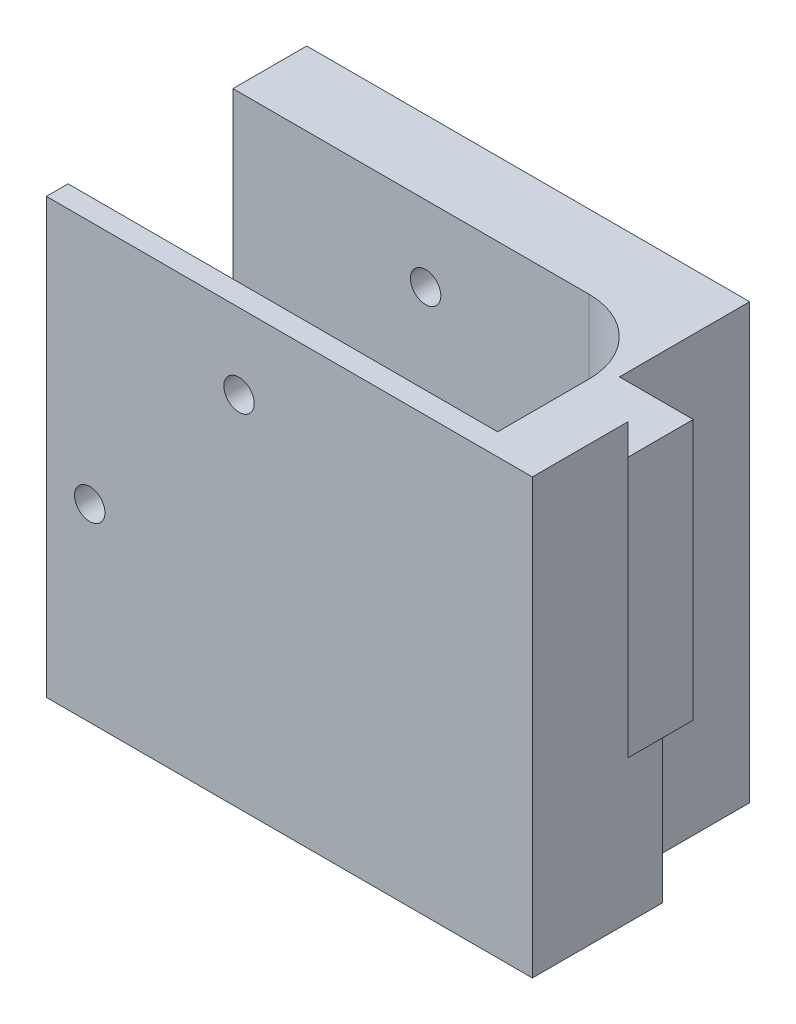
ISO-10303-21;
HEADER;
FILE_DESCRIPTION(('STEP AP214'),'2;1');
FILE_NAME('part.step','',(''),(''),'','','');
FILE_SCHEMA(('AUTOMOTIVE_DESIGN { 1 0 10303 214 1 1 1 1 }'));
ENDSEC;
DATA;
#1=APPLICATION_CONTEXT('core data for automotive mechanical design processes');
#2=APPLICATION_PROTOCOL_DEFINITION('international standard','automotive_design',2000,#1);
#3=PRODUCT_CONTEXT('',#1,'mechanical');
#4=PRODUCT('Part','Part','',(#3));
#5=PRODUCT_RELATED_PRODUCT_CATEGORY('part','',(#4));
#6=PRODUCT_DEFINITION_FORMATION('','',#4);
#7=PRODUCT_DEFINITION_CONTEXT('part definition',#1,'design');
#8=PRODUCT_DEFINITION('design','',#6,#7);
#9=PRODUCT_DEFINITION_SHAPE('','',#8);
#10=(LENGTH_UNIT() NAMED_UNIT(*) SI_UNIT(.MILLI.,.METRE.));
#11=(NAMED_UNIT(*) PLANE_ANGLE_UNIT() SI_UNIT($,.RADIAN.));
#12=(NAMED_UNIT(*) SI_UNIT($,.STERADIAN.) SOLID_ANGLE_UNIT());
#13=UNCERTAINTY_MEASURE_WITH_UNIT(LENGTH_MEASURE(1.E-05),#10,'distance_accuracy_value','');
#14=(GEOMETRIC_REPRESENTATION_CONTEXT(3) GLOBAL_UNCERTAINTY_ASSIGNED_CONTEXT((#13)) GLOBAL_UNIT_ASSIGNED_CONTEXT((#10,
#11,#12)) REPRESENTATION_CONTEXT('',''));
#15=CARTESIAN_POINT('',(0.,0.,0.));
#16=DIRECTION('',(0.,0.,1.));
#17=DIRECTION('',(1.,0.,0.));
#18=AXIS2_PLACEMENT_3D('',#15,#16,#17);
#19=CARTESIAN_POINT('',(71.0355339059328,-0.0100000000000031,15.));
#20=DIRECTION('',(0.,0.,1.));
#21=DIRECTION('',(1.,0.,0.));
#22=AXIS2_PLACEMENT_3D('',#19,#20,#21);
#23=PLANE('',#22);
#24=DIRECTION('',(0.,1.,0.));
#25=VECTOR('',#24,1.);
#26=CARTESIAN_POINT('',(51.0355339059328,-0.0100000000000031,15.));
#27=LINE('',#26,#25);
#28=CARTESIAN_POINT('',(51.0355339059328,0.,15.));
#29=VERTEX_POINT('',#28);
#30=CARTESIAN_POINT('',(51.0355339059328,50.,15.));
#31=VERTEX_POINT('',#30);
#32=EDGE_CURVE('E11',#29,#31,#27,.T.);
#33=ORIENTED_EDGE('',*,*,#32,.T.);
#34=DIRECTION('',(1.,0.,0.));
#35=VECTOR('',#34,1.);
#36=CARTESIAN_POINT('',(0.,50.,15.));
#37=LINE('',#36,#35);
#38=CARTESIAN_POINT('',(59.5355339059328,50.,15.));
#39=VERTEX_POINT('',#38);
#40=EDGE_CURVE('E308',#31,#39,#37,.T.);
#41=ORIENTED_EDGE('',*,*,#40,.T.);
#42=DIRECTION('',(0.,-1.,0.));
#43=VECTOR('',#42,1.);
#44=CARTESIAN_POINT('',(59.5355339059328,20.,15.));
#45=LINE('',#44,#43);
#46=CARTESIAN_POINT('',(59.5355339059328,20.,15.));
#47=VERTEX_POINT('',#46);
#48=EDGE_CURVE('E49',#39,#47,#45,.T.);
#49=ORIENTED_EDGE('',*,*,#48,.T.);
#50=DIRECTION('',(-1.,0.,0.));
#51=VECTOR('',#50,1.);
#52=CARTESIAN_POINT('',(0.,20.,15.));
#53=LINE('',#52,#51);
#54=CARTESIAN_POINT('',(56.,20.,15.));
#55=VERTEX_POINT('',#54);
#56=EDGE_CURVE('E64',#47,#55,#53,.T.);
#57=ORIENTED_EDGE('',*,*,#56,.T.);
#58=DIRECTION('',(0.,1.,0.));
#59=VECTOR('',#58,1.);
#60=CARTESIAN_POINT('',(56.,0.,15.));
#61=LINE('',#60,#59);
#62=CARTESIAN_POINT('',(56.,0.,15.));
#63=VERTEX_POINT('',#62);
#64=EDGE_CURVE('E152',#63,#55,#61,.T.);
#65=ORIENTED_EDGE('',*,*,#64,.F.);
#66=DIRECTION('',(1.,0.,0.));
#67=VECTOR('',#66,1.);
#68=CARTESIAN_POINT('',(0.,0.,15.));
#69=LINE('',#68,#67);
#70=EDGE_CURVE('E318',#29,#63,#69,.T.);
#71=ORIENTED_EDGE('',*,*,#70,.F.);
#72=EDGE_LOOP('',(#33,#41,#49,#57,#65,#71));
#73=FACE_BOUND('',#72,.T.);
#74=ADVANCED_FACE('F39',(#73),#23,.F.);
#75=CARTESIAN_POINT('',(51.0355339059328,-0.0100000000000031,15.));
#76=DIRECTION('',(-1.,0.,0.));
#77=DIRECTION('',(0.,0.,1.));
#78=AXIS2_PLACEMENT_3D('',#75,#76,#77);
#79=PLANE('',#78);
#80=DIRECTION('',(0.,-1.,0.));
#81=VECTOR('',#80,1.);
#82=CARTESIAN_POINT('',(51.0355339059328,0.,0.));
#83=LINE('',#82,#81);
#84=CARTESIAN_POINT('',(51.0355339059328,50.,0.));
#85=VERTEX_POINT('',#84);
#86=CARTESIAN_POINT('',(51.0355339059328,0.,0.));
#87=VERTEX_POINT('',#86);
#88=EDGE_CURVE('E155',#85,#87,#83,.T.);
#89=ORIENTED_EDGE('',*,*,#88,.F.);
#90=DIRECTION('',(0.,0.,1.));
#91=VECTOR('',#90,1.);
#92=CARTESIAN_POINT('',(51.0355339059328,50.,30.));
#93=LINE('',#92,#91);
#94=EDGE_CURVE('E311',#85,#31,#93,.T.);
#95=ORIENTED_EDGE('',*,*,#94,.T.);
#96=ORIENTED_EDGE('',*,*,#32,.F.);
#97=DIRECTION('',(0.,0.,1.));
#98=VECTOR('',#97,1.);
#99=CARTESIAN_POINT('',(51.0355339059328,0.,30.));
#100=LINE('',#99,#98);
#101=EDGE_CURVE('E43',#87,#29,#100,.T.);
#102=ORIENTED_EDGE('',*,*,#101,.F.);
#103=EDGE_LOOP('',(#89,#95,#96,#102));
#104=FACE_BOUND('',#103,.T.);
#105=ADVANCED_FACE('F41',(#104),#79,.F.);
#106=CARTESIAN_POINT('',(0.,0.,30.));
#107=DIRECTION('',(-1.,0.,0.));
#108=DIRECTION('',(0.,0.,1.));
#109=AXIS2_PLACEMENT_3D('',#106,#107,#108);
#110=PLANE('',#109);
#111=DIRECTION('',(0.,1.,0.));
#112=VECTOR('',#111,1.);
#113=CARTESIAN_POINT('',(0.,0.,27.5));
#114=LINE('',#113,#112);
#115=CARTESIAN_POINT('',(0.,0.,27.5));
#116=VERTEX_POINT('',#115);
#117=CARTESIAN_POINT('',(0.,50.,27.5));
#118=VERTEX_POINT('',#117);
#119=EDGE_CURVE('E214',#116,#118,#114,.T.);
#120=ORIENTED_EDGE('',*,*,#119,.F.);
#121=DIRECTION('',(0.,0.,-1.));
#122=VECTOR('',#121,1.);
#123=CARTESIAN_POINT('',(0.,0.,30.));
#124=LINE('',#123,#122);
#125=CARTESIAN_POINT('',(0.,0.,30.));
#126=VERTEX_POINT('',#125);
#127=EDGE_CURVE('E283',#126,#116,#124,.T.);
#128=ORIENTED_EDGE('',*,*,#127,.F.);
#129=DIRECTION('',(0.,1.,0.));
#130=VECTOR('',#129,1.);
#131=CARTESIAN_POINT('',(0.,0.,30.));
#132=LINE('',#131,#130);
#133=CARTESIAN_POINT('',(0.,50.,30.));
#134=VERTEX_POINT('',#133);
#135=EDGE_CURVE('E268',#126,#134,#132,.T.);
#136=ORIENTED_EDGE('',*,*,#135,.T.);
#137=DIRECTION('',(0.,0.,-1.));
#138=VECTOR('',#137,1.);
#139=CARTESIAN_POINT('',(0.,50.,30.));
#140=LINE('',#139,#138);
#141=EDGE_CURVE('E288',#134,#118,#140,.T.);
#142=ORIENTED_EDGE('',*,*,#141,.T.);
#143=EDGE_LOOP('',(#120,#128,#136,#142));
#144=FACE_BOUND('',#143,.T.);
#145=ADVANCED_FACE('F337',(#144),#110,.T.);
#146=CARTESIAN_POINT('',(22.2,41.3,30.));
#147=DIRECTION('',(0.,0.,-1.));
#148=DIRECTION('',(-1.,0.,0.));
#149=AXIS2_PLACEMENT_3D('',#146,#147,#148);
#150=CYLINDRICAL_SURFACE('',#149,1.75);
#151=CARTESIAN_POINT('',(22.2,41.3,27.5));
#152=DIRECTION('',(0.,0.,1.));
#153=DIRECTION('',(1.,0.,0.));
#154=AXIS2_PLACEMENT_3D('',#151,#152,#153);
#155=CIRCLE('',#154,1.75);
#156=CARTESIAN_POINT('',(23.95,41.3,27.5));
#157=VERTEX_POINT('',#156);
#158=EDGE_CURVE('E235',#157,#157,#155,.F.);
#159=ORIENTED_EDGE('',*,*,#158,.T.);
#160=EDGE_LOOP('',(#159));
#161=FACE_BOUND('',#160,.T.);
#162=CARTESIAN_POINT('',(22.2,41.3,30.));
#163=DIRECTION('',(0.,0.,-1.));
#164=DIRECTION('',(-1.,0.,0.));
#165=AXIS2_PLACEMENT_3D('',#162,#163,#164);
#166=CIRCLE('',#165,1.75);
#167=CARTESIAN_POINT('',(20.45,41.3,30.));
#168=VERTEX_POINT('',#167);
#169=EDGE_CURVE('E249',#168,#168,#166,.T.);
#170=ORIENTED_EDGE('',*,*,#169,.F.);
#171=EDGE_LOOP('',(#170));
#172=FACE_BOUND('',#171,.T.);
#173=ADVANCED_FACE('F378',(#161,#172),#150,.F.);
#174=CARTESIAN_POINT('',(5.,21.8,30.));
#175=DIRECTION('',(0.,0.,-1.));
#176=DIRECTION('',(-1.,0.,0.));
#177=AXIS2_PLACEMENT_3D('',#174,#175,#176);
#178=CYLINDRICAL_SURFACE('',#177,1.75);
#179=CARTESIAN_POINT('',(5.,21.8,27.5));
#180=DIRECTION('',(0.,0.,1.));
#181=DIRECTION('',(1.,0.,0.));
#182=AXIS2_PLACEMENT_3D('',#179,#180,#181);
#183=CIRCLE('',#182,1.75);
#184=CARTESIAN_POINT('',(6.75,21.8,27.5));
#185=VERTEX_POINT('',#184);
#186=EDGE_CURVE('E234',#185,#185,#183,.F.);
#187=ORIENTED_EDGE('',*,*,#186,.T.);
#188=EDGE_LOOP('',(#187));
#189=FACE_BOUND('',#188,.T.);
#190=CARTESIAN_POINT('',(5.,21.8,30.));
#191=DIRECTION('',(0.,0.,-1.));
#192=DIRECTION('',(-1.,0.,0.));
#193=AXIS2_PLACEMENT_3D('',#190,#191,#192);
#194=CIRCLE('',#193,1.75);
#195=CARTESIAN_POINT('',(3.25,21.8,30.));
#196=VERTEX_POINT('',#195);
#197=EDGE_CURVE('E240',#196,#196,#194,.T.);
#198=ORIENTED_EDGE('',*,*,#197,.F.);
#199=EDGE_LOOP('',(#198));
#200=FACE_BOUND('',#199,.T.);
#201=ADVANCED_FACE('F391',(#189,#200),#178,.F.);
#202=CARTESIAN_POINT('',(0.,0.,30.));
#203=DIRECTION('',(0.,1.,0.));
#204=DIRECTION('',(0.,0.,1.));
#205=AXIS2_PLACEMENT_3D('',#202,#203,#204);
#206=PLANE('',#205);
#207=DIRECTION('',(1.,0.,0.));
#208=VECTOR('',#207,1.);
#209=CARTESIAN_POINT('',(0.,0.,0.));
#210=LINE('',#209,#208);
#211=CARTESIAN_POINT('',(0.,0.,0.));
#212=VERTEX_POINT('',#211);
#213=EDGE_CURVE('E244',#212,#87,#210,.T.);
#214=ORIENTED_EDGE('',*,*,#213,.T.);
#215=ORIENTED_EDGE('',*,*,#101,.T.);
#216=ORIENTED_EDGE('',*,*,#70,.T.);
#217=DIRECTION('',(0.,0.,-1.));
#218=VECTOR('',#217,1.);
#219=CARTESIAN_POINT('',(56.,0.,30.));
#220=LINE('',#219,#218);
#221=CARTESIAN_POINT('',(56.,0.,30.));
#222=VERTEX_POINT('',#221);
#223=EDGE_CURVE('E156',#222,#63,#220,.T.);
#224=ORIENTED_EDGE('',*,*,#223,.F.);
#225=DIRECTION('',(1.,0.,0.));
#226=VECTOR('',#225,1.);
#227=CARTESIAN_POINT('',(0.,0.,30.));
#228=LINE('',#227,#226);
#229=EDGE_CURVE('E256',#126,#222,#228,.T.);
#230=ORIENTED_EDGE('',*,*,#229,.F.);
#231=ORIENTED_EDGE('',*,*,#127,.T.);
#232=DIRECTION('',(1.,0.,0.));
#233=VECTOR('',#232,1.);
#234=CARTESIAN_POINT('',(49.5,0.,27.5));
#235=LINE('',#234,#233);
#236=CARTESIAN_POINT('',(49.5,0.,27.5));
#237=VERTEX_POINT('',#236);
#238=EDGE_CURVE('E183',#116,#237,#235,.T.);
#239=ORIENTED_EDGE('',*,*,#238,.T.);
#240=DIRECTION('',(0.,0.,-1.));
#241=VECTOR('',#240,1.);
#242=CARTESIAN_POINT('',(49.5,0.,17.));
#243=LINE('',#242,#241);
#244=CARTESIAN_POINT('',(49.5,0.,17.));
#245=VERTEX_POINT('',#244);
#246=EDGE_CURVE('E187',#237,#245,#243,.T.);
#247=ORIENTED_EDGE('',*,*,#246,.T.);
#248=CARTESIAN_POINT('',(41.,0.,17.));
#249=DIRECTION('',(0.,1.,0.));
#250=DIRECTION('',(0.,0.,1.));
#251=AXIS2_PLACEMENT_3D('',#248,#249,#250);
#252=CIRCLE('',#251,8.50000000000001);
#253=CARTESIAN_POINT('',(41.,0.,8.49999999999999));
#254=VERTEX_POINT('',#253);
#255=EDGE_CURVE('E192',#245,#254,#252,.T.);
#256=ORIENTED_EDGE('',*,*,#255,.T.);
#257=DIRECTION('',(-1.,0.,0.));
#258=VECTOR('',#257,1.);
#259=CARTESIAN_POINT('',(0.,0.,8.49999999999999));
#260=LINE('',#259,#258);
#261=CARTESIAN_POINT('',(0.,0.,8.49999999999999));
#262=VERTEX_POINT('',#261);
#263=EDGE_CURVE('E196',#254,#262,#260,.T.);
#264=ORIENTED_EDGE('',*,*,#263,.T.);
#265=EDGE_CURVE('E272',#262,#212,#124,.T.);
#266=ORIENTED_EDGE('',*,*,#265,.T.);
#267=EDGE_LOOP('',(#214,#215,#216,#224,#230,#231,#239,#247,#256,#264,#266));
#268=FACE_BOUND('',#267,.T.);
#269=ADVANCED_FACE('F325',(#268),#206,.F.);
#270=CARTESIAN_POINT('',(56.,0.,30.));
#271=DIRECTION('',(-1.,0.,0.));
#272=DIRECTION('',(0.,-1.,0.));
#273=AXIS2_PLACEMENT_3D('',#270,#271,#272);
#274=PLANE('',#273);
#275=ORIENTED_EDGE('',*,*,#223,.T.);
#276=ORIENTED_EDGE('',*,*,#64,.T.);
#277=DIRECTION('',(0.,0.,1.));
#278=VECTOR('',#277,1.);
#279=CARTESIAN_POINT('',(56.,20.,30.));
#280=LINE('',#279,#278);
#281=CARTESIAN_POINT('',(56.,20.,18.9644660940673));
#282=VERTEX_POINT('',#281);
#283=EDGE_CURVE('E144',#55,#282,#280,.T.);
#284=ORIENTED_EDGE('',*,*,#283,.T.);
#285=DIRECTION('',(0.,1.,0.));
#286=VECTOR('',#285,1.);
#287=CARTESIAN_POINT('',(56.,20.,18.9644660940673));
#288=LINE('',#287,#286);
#289=CARTESIAN_POINT('',(56.,50.,18.9644660940673));
#290=VERTEX_POINT('',#289);
#291=EDGE_CURVE('E149',#282,#290,#288,.T.);
#292=ORIENTED_EDGE('',*,*,#291,.T.);
#293=DIRECTION('',(0.,0.,-1.));
#294=VECTOR('',#293,1.);
#295=CARTESIAN_POINT('',(56.,50.,30.));
#296=LINE('',#295,#294);
#297=CARTESIAN_POINT('',(56.,50.,30.));
#298=VERTEX_POINT('',#297);
#299=EDGE_CURVE('E292',#298,#290,#296,.T.);
#300=ORIENTED_EDGE('',*,*,#299,.F.);
#301=DIRECTION('',(0.,1.,0.));
#302=VECTOR('',#301,1.);
#303=CARTESIAN_POINT('',(56.,0.,30.));
#304=LINE('',#303,#302);
#305=EDGE_CURVE('E260',#222,#298,#304,.T.);
#306=ORIENTED_EDGE('',*,*,#305,.F.);
#307=EDGE_LOOP('',(#275,#276,#284,#292,#300,#306));
#308=FACE_BOUND('',#307,.T.);
#309=ADVANCED_FACE('F147',(#308),#274,.F.);
#310=CARTESIAN_POINT('',(0.,50.,30.));
#311=DIRECTION('',(0.,1.,0.));
#312=DIRECTION('',(0.,0.,1.));
#313=AXIS2_PLACEMENT_3D('',#310,#311,#312);
#314=PLANE('',#313);
#315=ORIENTED_EDGE('',*,*,#94,.F.);
#316=DIRECTION('',(1.,0.,0.));
#317=VECTOR('',#316,1.);
#318=CARTESIAN_POINT('',(0.,50.,0.));
#319=LINE('',#318,#317);
#320=CARTESIAN_POINT('',(0.,50.,0.));
#321=VERTEX_POINT('',#320);
#322=EDGE_CURVE('E276',#321,#85,#319,.T.);
#323=ORIENTED_EDGE('',*,*,#322,.F.);
#324=CARTESIAN_POINT('',(0.,50.,8.49999999999999));
#325=VERTEX_POINT('',#324);
#326=EDGE_CURVE('E287',#325,#321,#140,.T.);
#327=ORIENTED_EDGE('',*,*,#326,.F.);
#328=DIRECTION('',(-1.,0.,0.));
#329=VECTOR('',#328,1.);
#330=CARTESIAN_POINT('',(0.,50.,8.49999999999999));
#331=LINE('',#330,#329);
#332=CARTESIAN_POINT('',(41.,50.,8.49999999999999));
#333=VERTEX_POINT('',#332);
#334=EDGE_CURVE('E188',#333,#325,#331,.T.);
#335=ORIENTED_EDGE('',*,*,#334,.F.);
#336=CARTESIAN_POINT('',(41.,50.,17.));
#337=DIRECTION('',(0.,1.,0.));
#338=DIRECTION('',(0.,0.,1.));
#339=AXIS2_PLACEMENT_3D('',#336,#337,#338);
#340=CIRCLE('',#339,8.50000000000001);
#341=CARTESIAN_POINT('',(49.5,50.,17.));
#342=VERTEX_POINT('',#341);
#343=EDGE_CURVE('E208',#342,#333,#340,.T.);
#344=ORIENTED_EDGE('',*,*,#343,.F.);
#345=DIRECTION('',(0.,0.,-1.));
#346=VECTOR('',#345,1.);
#347=CARTESIAN_POINT('',(49.5,50.,17.));
#348=LINE('',#347,#346);
#349=CARTESIAN_POINT('',(49.5,50.,27.5));
#350=VERTEX_POINT('',#349);
#351=EDGE_CURVE('E204',#350,#342,#348,.T.);
#352=ORIENTED_EDGE('',*,*,#351,.F.);
#353=DIRECTION('',(1.,0.,0.));
#354=VECTOR('',#353,1.);
#355=CARTESIAN_POINT('',(49.5,50.,27.5));
#356=LINE('',#355,#354);
#357=EDGE_CURVE('E181',#118,#350,#356,.T.);
#358=ORIENTED_EDGE('',*,*,#357,.F.);
#359=ORIENTED_EDGE('',*,*,#141,.F.);
#360=DIRECTION('',(1.,0.,0.));
#361=VECTOR('',#360,1.);
#362=CARTESIAN_POINT('',(0.,50.,30.));
#363=LINE('',#362,#361);
#364=EDGE_CURVE('E264',#134,#298,#363,.T.);
#365=ORIENTED_EDGE('',*,*,#364,.T.);
#366=ORIENTED_EDGE('',*,*,#299,.T.);
#367=DIRECTION('',(0.707106781186565,0.,0.707106781186531));
#368=VECTOR('',#367,1.);
#369=CARTESIAN_POINT('',(59.5355339059328,50.,22.5));
#370=LINE('',#369,#368);
#371=CARTESIAN_POINT('',(59.5355339059328,50.,22.5));
#372=VERTEX_POINT('',#371);
#373=EDGE_CURVE('E163',#290,#372,#370,.T.);
#374=ORIENTED_EDGE('',*,*,#373,.T.);
#375=DIRECTION('',(0.,0.,-1.));
#376=VECTOR('',#375,1.);
#377=CARTESIAN_POINT('',(59.5355339059328,50.,7.5));
#378=LINE('',#377,#376);
#379=EDGE_CURVE('E170',#372,#39,#378,.T.);
#380=ORIENTED_EDGE('',*,*,#379,.T.);
#381=ORIENTED_EDGE('',*,*,#40,.F.);
#382=EDGE_LOOP('',(#315,#323,#327,#335,#344,#352,#358,#359,#365,#366,#374,#380,#381));
#383=FACE_BOUND('',#382,.T.);
#384=ADVANCED_FACE('F344',(#383),#314,.T.);
#385=DIRECTION('',(0.,1.,0.));
#386=VECTOR('',#385,1.);
#387=CARTESIAN_POINT('',(0.,0.,8.49999999999999));
#388=LINE('',#387,#386);
#389=EDGE_CURVE('E218',#262,#325,#388,.T.);
#390=ORIENTED_EDGE('',*,*,#389,.T.);
#391=ORIENTED_EDGE('',*,*,#326,.T.);
#392=DIRECTION('',(0.,1.,0.));
#393=VECTOR('',#392,1.);
#394=CARTESIAN_POINT('',(0.,0.,0.));
#395=LINE('',#394,#393);
#396=EDGE_CURVE('E261',#212,#321,#395,.T.);
#397=ORIENTED_EDGE('',*,*,#396,.F.);
#398=ORIENTED_EDGE('',*,*,#265,.F.);
#399=EDGE_LOOP('',(#390,#391,#397,#398));
#400=FACE_BOUND('',#399,.T.);
#401=ADVANCED_FACE('F360',(#400),#110,.T.);
#402=CARTESIAN_POINT('',(0.,0.,30.));
#403=DIRECTION('',(0.,0.,1.));
#404=DIRECTION('',(1.,0.,0.));
#405=AXIS2_PLACEMENT_3D('',#402,#403,#404);
#406=PLANE('',#405);
#407=ORIENTED_EDGE('',*,*,#197,.T.);
#408=EDGE_LOOP('',(#407));
#409=FACE_BOUND('',#408,.T.);
#410=ORIENTED_EDGE('',*,*,#169,.T.);
#411=EDGE_LOOP('',(#410));
#412=FACE_BOUND('',#411,.T.);
#413=ORIENTED_EDGE('',*,*,#229,.T.);
#414=ORIENTED_EDGE('',*,*,#305,.T.);
#415=ORIENTED_EDGE('',*,*,#364,.F.);
#416=ORIENTED_EDGE('',*,*,#135,.F.);
#417=EDGE_LOOP('',(#413,#414,#415,#416));
#418=FACE_BOUND('',#417,.T.);
#419=ADVANCED_FACE('F334',(#409,#412,#418),#406,.T.);
#420=CARTESIAN_POINT('',(0.,0.,0.));
#421=DIRECTION('',(0.,0.,1.));
#422=DIRECTION('',(1.,0.,0.));
#423=AXIS2_PLACEMENT_3D('',#420,#421,#422);
#424=PLANE('',#423);
#425=CARTESIAN_POINT('',(5.,21.8,0.));
#426=DIRECTION('',(0.,0.,-1.));
#427=DIRECTION('',(-1.,0.,0.));
#428=AXIS2_PLACEMENT_3D('',#425,#426,#427);
#429=CIRCLE('',#428,1.75);
#430=CARTESIAN_POINT('',(3.25,21.8,0.));
#431=VERTEX_POINT('',#430);
#432=EDGE_CURVE('E245',#431,#431,#429,.T.);
#433=ORIENTED_EDGE('',*,*,#432,.F.);
#434=EDGE_LOOP('',(#433));
#435=FACE_BOUND('',#434,.T.);
#436=CARTESIAN_POINT('',(22.2,41.3,0.));
#437=DIRECTION('',(0.,0.,-1.));
#438=DIRECTION('',(-1.,0.,0.));
#439=AXIS2_PLACEMENT_3D('',#436,#437,#438);
#440=CIRCLE('',#439,1.75);
#441=CARTESIAN_POINT('',(20.45,41.3,0.));
#442=VERTEX_POINT('',#441);
#443=EDGE_CURVE('E239',#442,#442,#440,.T.);
#444=ORIENTED_EDGE('',*,*,#443,.F.);
#445=EDGE_LOOP('',(#444));
#446=FACE_BOUND('',#445,.T.);
#447=ORIENTED_EDGE('',*,*,#322,.T.);
#448=ORIENTED_EDGE('',*,*,#88,.T.);
#449=ORIENTED_EDGE('',*,*,#213,.F.);
#450=ORIENTED_EDGE('',*,*,#396,.T.);
#451=EDGE_LOOP('',(#447,#448,#449,#450));
#452=FACE_BOUND('',#451,.T.);
#453=ADVANCED_FACE('F366',(#435,#446,#452),#424,.F.);
#454=CARTESIAN_POINT('',(22.2,41.3,8.49999999999999));
#455=DIRECTION('',(0.,0.,-1.));
#456=DIRECTION('',(-1.,0.,0.));
#457=AXIS2_PLACEMENT_3D('',#454,#455,#456);
#458=CIRCLE('',#457,1.75);
#459=CARTESIAN_POINT('',(20.45,41.3,8.49999999999999));
#460=VERTEX_POINT('',#459);
#461=EDGE_CURVE('E230',#460,#460,#458,.F.);
#462=ORIENTED_EDGE('',*,*,#461,.T.);
#463=EDGE_LOOP('',(#462));
#464=FACE_BOUND('',#463,.T.);
#465=ORIENTED_EDGE('',*,*,#443,.T.);
#466=EDGE_LOOP('',(#465));
#467=FACE_BOUND('',#466,.T.);
#468=ADVANCED_FACE('F368',(#464,#467),#150,.F.);
#469=CARTESIAN_POINT('',(5.,21.8,8.49999999999999));
#470=DIRECTION('',(0.,0.,-1.));
#471=DIRECTION('',(-1.,0.,0.));
#472=AXIS2_PLACEMENT_3D('',#469,#470,#471);
#473=CIRCLE('',#472,1.75);
#474=CARTESIAN_POINT('',(3.25,21.8,8.49999999999999));
#475=VERTEX_POINT('',#474);
#476=EDGE_CURVE('E217',#475,#475,#473,.F.);
#477=ORIENTED_EDGE('',*,*,#476,.T.);
#478=EDGE_LOOP('',(#477));
#479=FACE_BOUND('',#478,.T.);
#480=ORIENTED_EDGE('',*,*,#432,.T.);
#481=EDGE_LOOP('',(#480));
#482=FACE_BOUND('',#481,.T.);
#483=ADVANCED_FACE('F375',(#479,#482),#178,.F.);
#484=CARTESIAN_POINT('',(49.5,0.,27.5));
#485=DIRECTION('',(0.,0.,1.));
#486=DIRECTION('',(1.,0.,0.));
#487=AXIS2_PLACEMENT_3D('',#484,#485,#486);
#488=PLANE('',#487);
#489=ORIENTED_EDGE('',*,*,#186,.F.);
#490=EDGE_LOOP('',(#489));
#491=FACE_BOUND('',#490,.T.);
#492=ORIENTED_EDGE('',*,*,#357,.T.);
#493=DIRECTION('',(0.,1.,0.));
#494=VECTOR('',#493,1.);
#495=CARTESIAN_POINT('',(49.5,0.,27.5));
#496=LINE('',#495,#494);
#497=EDGE_CURVE('E200',#237,#350,#496,.T.);
#498=ORIENTED_EDGE('',*,*,#497,.F.);
#499=ORIENTED_EDGE('',*,*,#238,.F.);
#500=ORIENTED_EDGE('',*,*,#119,.T.);
#501=EDGE_LOOP('',(#492,#498,#499,#500));
#502=FACE_BOUND('',#501,.T.);
#503=ORIENTED_EDGE('',*,*,#158,.F.);
#504=EDGE_LOOP('',(#503));
#505=FACE_BOUND('',#504,.T.);
#506=ADVANCED_FACE('F340',(#491,#502,#505),#488,.F.);
#507=CARTESIAN_POINT('',(0.,0.,8.49999999999999));
#508=DIRECTION('',(0.,0.,-1.));
#509=DIRECTION('',(-1.,0.,0.));
#510=AXIS2_PLACEMENT_3D('',#507,#508,#509);
#511=PLANE('',#510);
#512=ORIENTED_EDGE('',*,*,#476,.F.);
#513=EDGE_LOOP('',(#512));
#514=FACE_BOUND('',#513,.T.);
#515=ORIENTED_EDGE('',*,*,#334,.T.);
#516=ORIENTED_EDGE('',*,*,#389,.F.);
#517=ORIENTED_EDGE('',*,*,#263,.F.);
#518=DIRECTION('',(0.,1.,0.));
#519=VECTOR('',#518,1.);
#520=CARTESIAN_POINT('',(41.,0.,8.49999999999999));
#521=LINE('',#520,#519);
#522=EDGE_CURVE('E222',#254,#333,#521,.T.);
#523=ORIENTED_EDGE('',*,*,#522,.T.);
#524=EDGE_LOOP('',(#515,#516,#517,#523));
#525=FACE_BOUND('',#524,.T.);
#526=ORIENTED_EDGE('',*,*,#461,.F.);
#527=EDGE_LOOP('',(#526));
#528=FACE_BOUND('',#527,.T.);
#529=ADVANCED_FACE('F356',(#514,#525,#528),#511,.F.);
#530=CARTESIAN_POINT('',(41.,0.,17.));
#531=DIRECTION('',(0.,1.,0.));
#532=DIRECTION('',(0.,0.,1.));
#533=AXIS2_PLACEMENT_3D('',#530,#531,#532);
#534=CYLINDRICAL_SURFACE('',#533,8.50000000000001);
#535=ORIENTED_EDGE('',*,*,#343,.T.);
#536=ORIENTED_EDGE('',*,*,#522,.F.);
#537=ORIENTED_EDGE('',*,*,#255,.F.);
#538=DIRECTION('',(0.,1.,0.));
#539=VECTOR('',#538,1.);
#540=CARTESIAN_POINT('',(49.5,0.,17.));
#541=LINE('',#540,#539);
#542=EDGE_CURVE('E225',#245,#342,#541,.T.);
#543=ORIENTED_EDGE('',*,*,#542,.T.);
#544=EDGE_LOOP('',(#535,#536,#537,#543));
#545=FACE_BOUND('',#544,.T.);
#546=ADVANCED_FACE('F354',(#545),#534,.F.);
#547=CARTESIAN_POINT('',(49.5,0.,17.));
#548=DIRECTION('',(1.,0.,0.));
#549=DIRECTION('',(0.,0.,-1.));
#550=AXIS2_PLACEMENT_3D('',#547,#548,#549);
#551=PLANE('',#550);
#552=ORIENTED_EDGE('',*,*,#351,.T.);
#553=ORIENTED_EDGE('',*,*,#542,.F.);
#554=ORIENTED_EDGE('',*,*,#246,.F.);
#555=ORIENTED_EDGE('',*,*,#497,.T.);
#556=EDGE_LOOP('',(#552,#553,#554,#555));
#557=FACE_BOUND('',#556,.T.);
#558=ADVANCED_FACE('F348',(#557),#551,.F.);
#559=CARTESIAN_POINT('',(0.,20.,0.));
#560=DIRECTION('',(0.,-1.,0.));
#561=DIRECTION('',(0.,0.,-1.));
#562=AXIS2_PLACEMENT_3D('',#559,#560,#561);
#563=PLANE('',#562);
#564=ORIENTED_EDGE('',*,*,#56,.F.);
#565=DIRECTION('',(0.,0.,-1.));
#566=VECTOR('',#565,1.);
#567=CARTESIAN_POINT('',(59.5355339059328,20.,7.5));
#568=LINE('',#567,#566);
#569=CARTESIAN_POINT('',(59.5355339059328,20.,22.5));
#570=VERTEX_POINT('',#569);
#571=EDGE_CURVE('E166',#570,#47,#568,.T.);
#572=ORIENTED_EDGE('',*,*,#571,.F.);
#573=DIRECTION('',(0.707106781186565,0.,0.707106781186531));
#574=VECTOR('',#573,1.);
#575=CARTESIAN_POINT('',(59.5355339059328,20.,22.5));
#576=LINE('',#575,#574);
#577=EDGE_CURVE('E161',#282,#570,#576,.T.);
#578=ORIENTED_EDGE('',*,*,#577,.F.);
#579=ORIENTED_EDGE('',*,*,#283,.F.);
#580=EDGE_LOOP('',(#564,#572,#578,#579));
#581=FACE_BOUND('',#580,.T.);
#582=ADVANCED_FACE('F168',(#581),#563,.T.);
#583=CARTESIAN_POINT('',(59.5355339059328,20.,7.5));
#584=DIRECTION('',(1.,0.,0.));
#585=DIRECTION('',(0.,0.,-1.));
#586=AXIS2_PLACEMENT_3D('',#583,#584,#585);
#587=PLANE('',#586);
#588=ORIENTED_EDGE('',*,*,#48,.F.);
#589=ORIENTED_EDGE('',*,*,#379,.F.);
#590=DIRECTION('',(0.,1.,0.));
#591=VECTOR('',#590,1.);
#592=CARTESIAN_POINT('',(59.5355339059328,20.,22.5));
#593=LINE('',#592,#591);
#594=EDGE_CURVE('E165',#570,#372,#593,.T.);
#595=ORIENTED_EDGE('',*,*,#594,.F.);
#596=ORIENTED_EDGE('',*,*,#571,.T.);
#597=EDGE_LOOP('',(#588,#589,#595,#596));
#598=FACE_BOUND('',#597,.T.);
#599=ADVANCED_FACE('F424',(#598),#587,.T.);
#600=CARTESIAN_POINT('',(59.5355339059328,20.,22.5));
#601=DIRECTION('',(-0.70710678118653,0.,0.707106781186564));
#602=DIRECTION('',(0.707106781186565,0.,0.707106781186531));
#603=AXIS2_PLACEMENT_3D('',#600,#601,#602);
#604=PLANE('',#603);
#605=ORIENTED_EDGE('',*,*,#373,.F.);
#606=ORIENTED_EDGE('',*,*,#291,.F.);
#607=ORIENTED_EDGE('',*,*,#577,.T.);
#608=ORIENTED_EDGE('',*,*,#594,.T.);
#609=EDGE_LOOP('',(#605,#606,#607,#608));
#610=FACE_BOUND('',#609,.T.);
#611=ADVANCED_FACE('F160',(#610),#604,.T.);
#612=CLOSED_SHELL('',(#74,#105,#145,#173,#201,#269,#309,#384,#401,#419,#453,#468,#483,#506,#529,
#546,#558,#582,#599,#611));
#613=MANIFOLD_SOLID_BREP('B2',#612);
#614=ADVANCED_BREP_SHAPE_REPRESENTATION('',(#18,#613),#14);
#615=SHAPE_DEFINITION_REPRESENTATION(#9,#614);
ENDSEC;
END-ISO-10303-21;
